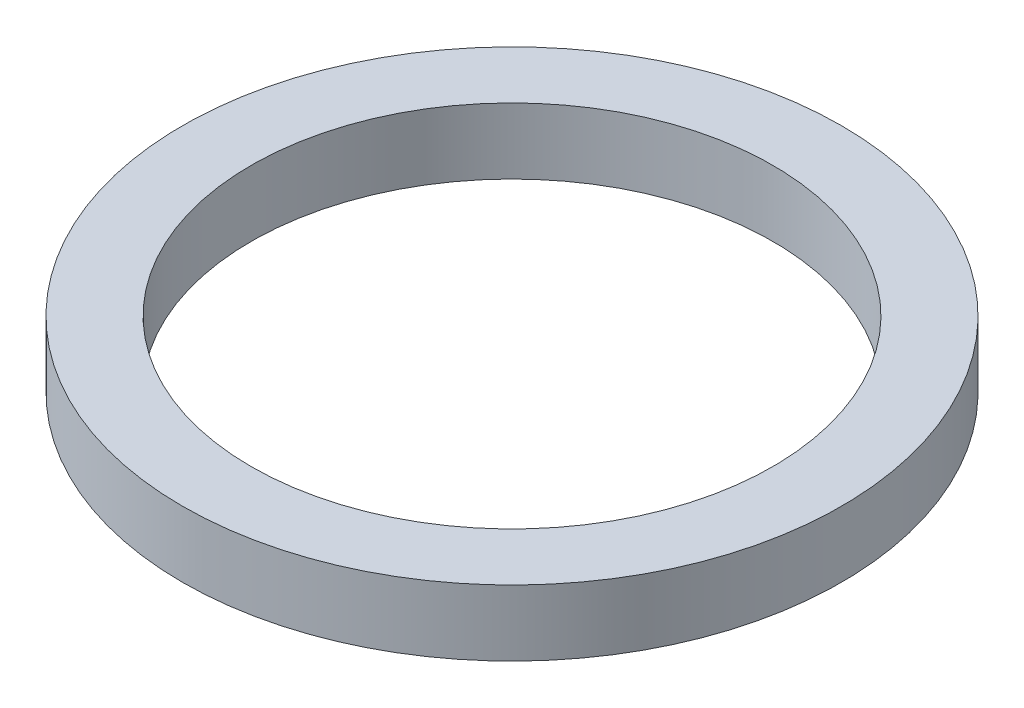
ISO-10303-21;
HEADER;
FILE_DESCRIPTION(('STEP AP214'),'2;1');
FILE_NAME('part.step','',(''),(''),'','','');
FILE_SCHEMA(('AUTOMOTIVE_DESIGN { 1 0 10303 214 1 1 1 1 }'));
ENDSEC;
DATA;
#1=APPLICATION_CONTEXT('core data for automotive mechanical design processes');
#2=APPLICATION_PROTOCOL_DEFINITION('international standard','automotive_design',2000,#1);
#3=PRODUCT_CONTEXT('',#1,'mechanical');
#4=PRODUCT('Part','Part','',(#3));
#5=PRODUCT_RELATED_PRODUCT_CATEGORY('part','',(#4));
#6=PRODUCT_DEFINITION_FORMATION('','',#4);
#7=PRODUCT_DEFINITION_CONTEXT('part definition',#1,'design');
#8=PRODUCT_DEFINITION('design','',#6,#7);
#9=PRODUCT_DEFINITION_SHAPE('','',#8);
#10=(LENGTH_UNIT() NAMED_UNIT(*) SI_UNIT(.MILLI.,.METRE.));
#11=(NAMED_UNIT(*) PLANE_ANGLE_UNIT() SI_UNIT($,.RADIAN.));
#12=(NAMED_UNIT(*) SI_UNIT($,.STERADIAN.) SOLID_ANGLE_UNIT());
#13=UNCERTAINTY_MEASURE_WITH_UNIT(LENGTH_MEASURE(1.E-05),#10,'distance_accuracy_value','');
#14=(GEOMETRIC_REPRESENTATION_CONTEXT(3) GLOBAL_UNCERTAINTY_ASSIGNED_CONTEXT((#13)) GLOBAL_UNIT_ASSIGNED_CONTEXT((#10,
#11,#12)) REPRESENTATION_CONTEXT('',''));
#15=CARTESIAN_POINT('',(0.,0.,0.));
#16=DIRECTION('',(0.,0.,1.));
#17=DIRECTION('',(1.,0.,0.));
#18=AXIS2_PLACEMENT_3D('',#15,#16,#17);
#19=CARTESIAN_POINT('',(0.,12.,0.));
#20=DIRECTION('',(0.,-1.,0.));
#21=DIRECTION('',(0.,0.,-1.));
#22=AXIS2_PLACEMENT_3D('',#19,#20,#21);
#23=CYLINDRICAL_SURFACE('',#22,60.);
#24=CARTESIAN_POINT('',(0.,12.,0.));
#25=DIRECTION('',(0.,1.,0.));
#26=DIRECTION('',(0.,0.,1.));
#27=AXIS2_PLACEMENT_3D('',#24,#25,#26);
#28=CIRCLE('',#27,60.);
#29=CARTESIAN_POINT('',(0.,12.,60.));
#30=VERTEX_POINT('',#29);
#31=EDGE_CURVE('E10',#30,#30,#28,.T.);
#32=ORIENTED_EDGE('',*,*,#31,.F.);
#33=EDGE_LOOP('',(#32));
#34=FACE_BOUND('',#33,.T.);
#35=CARTESIAN_POINT('',(0.,0.,0.));
#36=DIRECTION('',(0.,1.,0.));
#37=DIRECTION('',(0.,0.,1.));
#38=AXIS2_PLACEMENT_3D('',#35,#36,#37);
#39=CIRCLE('',#38,60.);
#40=CARTESIAN_POINT('',(0.,0.,60.));
#41=VERTEX_POINT('',#40);
#42=EDGE_CURVE('E37',#41,#41,#39,.T.);
#43=ORIENTED_EDGE('',*,*,#42,.T.);
#44=EDGE_LOOP('',(#43));
#45=FACE_BOUND('',#44,.T.);
#46=ADVANCED_FACE('F40',(#34,#45),#23,.T.);
#47=CARTESIAN_POINT('',(0.,12.,0.));
#48=DIRECTION('',(0.,1.,0.));
#49=DIRECTION('',(0.,0.,1.));
#50=AXIS2_PLACEMENT_3D('',#47,#48,#49);
#51=PLANE('',#50);
#52=CARTESIAN_POINT('',(0.,12.,0.));
#53=DIRECTION('',(0.,1.,0.));
#54=DIRECTION('',(0.,0.,1.));
#55=AXIS2_PLACEMENT_3D('',#52,#53,#54);
#56=CIRCLE('',#55,47.5);
#57=CARTESIAN_POINT('',(0.,12.,47.5));
#58=VERTEX_POINT('',#57);
#59=EDGE_CURVE('E50',#58,#58,#56,.T.);
#60=ORIENTED_EDGE('',*,*,#59,.F.);
#61=EDGE_LOOP('',(#60));
#62=FACE_BOUND('',#61,.T.);
#63=ORIENTED_EDGE('',*,*,#31,.T.);
#64=EDGE_LOOP('',(#63));
#65=FACE_BOUND('',#64,.T.);
#66=ADVANCED_FACE('F59',(#62,#65),#51,.T.);
#67=CARTESIAN_POINT('',(0.,0.,0.));
#68=DIRECTION('',(0.,1.,0.));
#69=DIRECTION('',(0.,0.,1.));
#70=AXIS2_PLACEMENT_3D('',#67,#68,#69);
#71=PLANE('',#70);
#72=CARTESIAN_POINT('',(0.,0.,0.));
#73=DIRECTION('',(0.,1.,0.));
#74=DIRECTION('',(0.,0.,1.));
#75=AXIS2_PLACEMENT_3D('',#72,#73,#74);
#76=CIRCLE('',#75,47.5);
#77=CARTESIAN_POINT('',(0.,0.,47.5));
#78=VERTEX_POINT('',#77);
#79=EDGE_CURVE('E47',#78,#78,#76,.T.);
#80=ORIENTED_EDGE('',*,*,#79,.T.);
#81=EDGE_LOOP('',(#80));
#82=FACE_BOUND('',#81,.T.);
#83=ORIENTED_EDGE('',*,*,#42,.F.);
#84=EDGE_LOOP('',(#83));
#85=FACE_BOUND('',#84,.T.);
#86=ADVANCED_FACE('F58',(#82,#85),#71,.F.);
#87=CARTESIAN_POINT('',(0.,12.,0.));
#88=DIRECTION('',(0.,-1.,0.));
#89=DIRECTION('',(0.,0.,-1.));
#90=AXIS2_PLACEMENT_3D('',#87,#88,#89);
#91=CYLINDRICAL_SURFACE('',#90,47.5);
#92=ORIENTED_EDGE('',*,*,#59,.T.);
#93=EDGE_LOOP('',(#92));
#94=FACE_BOUND('',#93,.T.);
#95=ORIENTED_EDGE('',*,*,#79,.F.);
#96=EDGE_LOOP('',(#95));
#97=FACE_BOUND('',#96,.T.);
#98=ADVANCED_FACE('F54',(#94,#97),#91,.F.);
#99=CLOSED_SHELL('',(#46,#66,#86,#98));
#100=MANIFOLD_SOLID_BREP('B2',#99);
#101=ADVANCED_BREP_SHAPE_REPRESENTATION('',(#18,#100),#14);
#102=SHAPE_DEFINITION_REPRESENTATION(#9,#101);
ENDSEC;
END-ISO-10303-21;
